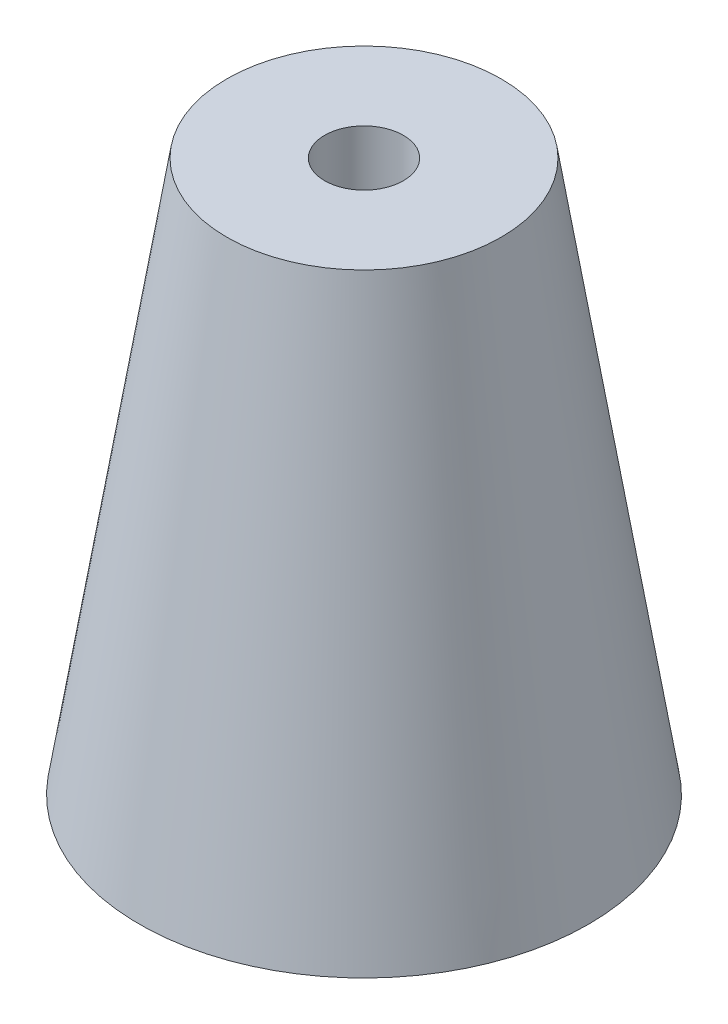
ISO-10303-21;
HEADER;
FILE_DESCRIPTION(('STEP AP214'),'2;1');
FILE_NAME('part.step','',(''),(''),'','','');
FILE_SCHEMA(('AUTOMOTIVE_DESIGN { 1 0 10303 214 1 1 1 1 }'));
ENDSEC;
DATA;
#1=APPLICATION_CONTEXT('core data for automotive mechanical design processes');
#2=APPLICATION_PROTOCOL_DEFINITION('international standard','automotive_design',2000,#1);
#3=PRODUCT_CONTEXT('',#1,'mechanical');
#4=PRODUCT('Part','Part','',(#3));
#5=PRODUCT_RELATED_PRODUCT_CATEGORY('part','',(#4));
#6=PRODUCT_DEFINITION_FORMATION('','',#4);
#7=PRODUCT_DEFINITION_CONTEXT('part definition',#1,'design');
#8=PRODUCT_DEFINITION('design','',#6,#7);
#9=PRODUCT_DEFINITION_SHAPE('','',#8);
#10=(LENGTH_UNIT() NAMED_UNIT(*) SI_UNIT(.MILLI.,.METRE.));
#11=(NAMED_UNIT(*) PLANE_ANGLE_UNIT() SI_UNIT($,.RADIAN.));
#12=(NAMED_UNIT(*) SI_UNIT($,.STERADIAN.) SOLID_ANGLE_UNIT());
#13=UNCERTAINTY_MEASURE_WITH_UNIT(LENGTH_MEASURE(1.E-05),#10,'distance_accuracy_value','');
#14=(GEOMETRIC_REPRESENTATION_CONTEXT(3) GLOBAL_UNCERTAINTY_ASSIGNED_CONTEXT((#13)) GLOBAL_UNIT_ASSIGNED_CONTEXT((#10,
#11,#12)) REPRESENTATION_CONTEXT('',''));
#15=CARTESIAN_POINT('',(0.,0.,0.));
#16=DIRECTION('',(0.,0.,1.));
#17=DIRECTION('',(1.,0.,0.));
#18=AXIS2_PLACEMENT_3D('',#15,#16,#17);
#19=CARTESIAN_POINT('',(0.,0.,0.));
#20=DIRECTION('',(0.,1.,0.));
#21=DIRECTION('',(-1.,0.,0.));
#22=AXIS2_PLACEMENT_3D('',#19,#20,#21);
#23=PLANE('',#22);
#24=CARTESIAN_POINT('',(0.,0.,0.));
#25=DIRECTION('',(0.,1.,0.));
#26=DIRECTION('',(-1.,0.,0.));
#27=AXIS2_PLACEMENT_3D('',#24,#25,#26);
#28=CIRCLE('',#27,7.62);
#29=CARTESIAN_POINT('',(-7.62,0.,0.));
#30=VERTEX_POINT('',#29);
#31=EDGE_CURVE('E82',#30,#30,#28,.F.);
#32=ORIENTED_EDGE('',*,*,#31,.T.);
#33=EDGE_LOOP('',(#32));
#34=FACE_BOUND('',#33,.T.);
#35=CARTESIAN_POINT('',(0.,0.,0.));
#36=DIRECTION('',(0.,-1.,0.));
#37=DIRECTION('',(1.,0.,0.));
#38=AXIS2_PLACEMENT_3D('',#35,#36,#37);
#39=CIRCLE('',#38,6.35);
#40=CARTESIAN_POINT('',(6.35,0.,0.));
#41=VERTEX_POINT('',#40);
#42=EDGE_CURVE('E76',#41,#41,#39,.T.);
#43=ORIENTED_EDGE('',*,*,#42,.F.);
#44=EDGE_LOOP('',(#43));
#45=FACE_BOUND('',#44,.T.);
#46=ADVANCED_FACE('F41',(#34,#45),#23,.F.);
#47=CARTESIAN_POINT('',(0.,0.,0.));
#48=DIRECTION('',(0.,1.,0.));
#49=DIRECTION('',(-1.,0.,0.));
#50=AXIS2_PLACEMENT_3D('',#47,#48,#49);
#51=CIRCLE('',#50,34.9091794421676);
#52=CARTESIAN_POINT('',(-34.9091794421676,0.,0.));
#53=VERTEX_POINT('',#52);
#54=EDGE_CURVE('E79',#53,#53,#51,.T.);
#55=ORIENTED_EDGE('',*,*,#54,.T.);
#56=EDGE_LOOP('',(#55));
#57=FACE_BOUND('',#56,.T.);
#58=CARTESIAN_POINT('',(0.,0.,0.));
#59=DIRECTION('',(0.,1.,0.));
#60=DIRECTION('',(-1.,0.,0.));
#61=AXIS2_PLACEMENT_3D('',#58,#59,#60);
#62=CIRCLE('',#61,36.195);
#63=CARTESIAN_POINT('',(-36.195,0.,0.));
#64=VERTEX_POINT('',#63);
#65=EDGE_CURVE('E68',#64,#64,#62,.T.);
#66=ORIENTED_EDGE('',*,*,#65,.F.);
#67=EDGE_LOOP('',(#66));
#68=FACE_BOUND('',#67,.T.);
#69=ADVANCED_FACE('F90',(#57,#68),#23,.F.);
#70=CARTESIAN_POINT('',(0.,0.,0.));
#71=DIRECTION('',(0.,-1.,0.));
#72=DIRECTION('',(1.,0.,0.));
#73=AXIS2_PLACEMENT_3D('',#70,#71,#72);
#74=CONICAL_SURFACE('',#73,36.195,0.157029775971732);
#75=CARTESIAN_POINT('',(0.,88.9,0.));
#76=DIRECTION('',(0.,1.,0.));
#77=DIRECTION('',(-1.,0.,0.));
#78=AXIS2_PLACEMENT_3D('',#75,#76,#77);
#79=CIRCLE('',#78,22.1191666666666);
#80=CARTESIAN_POINT('',(-22.1191666666666,88.9,0.));
#81=VERTEX_POINT('',#80);
#82=EDGE_CURVE('E72',#81,#81,#79,.T.);
#83=ORIENTED_EDGE('',*,*,#82,.F.);
#84=EDGE_LOOP('',(#83));
#85=FACE_BOUND('',#84,.T.);
#86=ORIENTED_EDGE('',*,*,#65,.T.);
#87=EDGE_LOOP('',(#86));
#88=FACE_BOUND('',#87,.T.);
#89=ADVANCED_FACE('F112',(#85,#88),#74,.T.);
#90=CARTESIAN_POINT('',(0.,88.9,0.));
#91=DIRECTION('',(0.,-1.,0.));
#92=DIRECTION('',(1.,0.,0.));
#93=AXIS2_PLACEMENT_3D('',#90,#91,#92);
#94=PLANE('',#93);
#95=CARTESIAN_POINT('',(0.,88.9,0.));
#96=DIRECTION('',(0.,-1.,0.));
#97=DIRECTION('',(1.,0.,0.));
#98=AXIS2_PLACEMENT_3D('',#95,#96,#97);
#99=CIRCLE('',#98,6.35);
#100=CARTESIAN_POINT('',(6.35000000000002,88.9,0.));
#101=VERTEX_POINT('',#100);
#102=EDGE_CURVE('E75',#101,#101,#99,.T.);
#103=ORIENTED_EDGE('',*,*,#102,.T.);
#104=EDGE_LOOP('',(#103));
#105=FACE_BOUND('',#104,.T.);
#106=ORIENTED_EDGE('',*,*,#82,.T.);
#107=EDGE_LOOP('',(#106));
#108=FACE_BOUND('',#107,.T.);
#109=ADVANCED_FACE('F104',(#105,#108),#94,.F.);
#110=CARTESIAN_POINT('',(0.,88.9,0.));
#111=DIRECTION('',(0.,-1.,0.));
#112=DIRECTION('',(1.,0.,0.));
#113=AXIS2_PLACEMENT_3D('',#110,#111,#112);
#114=CYLINDRICAL_SURFACE('',#113,6.35);
#115=ORIENTED_EDGE('',*,*,#102,.F.);
#116=EDGE_LOOP('',(#115));
#117=FACE_BOUND('',#116,.T.);
#118=ORIENTED_EDGE('',*,*,#42,.T.);
#119=EDGE_LOOP('',(#118));
#120=FACE_BOUND('',#119,.T.);
#121=ADVANCED_FACE('F96',(#117,#120),#114,.F.);
#122=CARTESIAN_POINT('',(0.,-0.198609231885217,0.));
#123=DIRECTION('',(0.,-1.,0.));
#124=DIRECTION('',(1.,0.,0.));
#125=AXIS2_PLACEMENT_3D('',#122,#123,#124);
#126=CONICAL_SURFACE('',#125,34.9406259038827,0.157029775971732);
#127=CARTESIAN_POINT('',(0.,85.4872184637705,0.));
#128=DIRECTION('',(0.,-1.,0.));
#129=DIRECTION('',(1.,0.,0.));
#130=AXIS2_PLACEMENT_3D('',#127,#128,#129);
#131=CIRCLE('',#130,21.3737031854039);
#132=CARTESIAN_POINT('',(21.3737031854039,85.4872184637705,0.));
#133=VERTEX_POINT('',#132);
#134=EDGE_CURVE('E62',#133,#133,#131,.F.);
#135=ORIENTED_EDGE('',*,*,#134,.T.);
#136=EDGE_LOOP('',(#135));
#137=FACE_BOUND('',#136,.T.);
#138=ORIENTED_EDGE('',*,*,#54,.F.);
#139=EDGE_LOOP('',(#138));
#140=FACE_BOUND('',#139,.T.);
#141=ADVANCED_FACE('F93',(#137,#140),#126,.F.);
#142=CARTESIAN_POINT('',(0.,87.63,0.));
#143=DIRECTION('',(0.,-1.,0.));
#144=DIRECTION('',(1.,0.,0.));
#145=AXIS2_PLACEMENT_3D('',#142,#143,#144);
#146=PLANE('',#145);
#147=CARTESIAN_POINT('',(0.,87.63,0.));
#148=DIRECTION('',(0.,-1.,0.));
#149=DIRECTION('',(1.,0.,0.));
#150=AXIS2_PLACEMENT_3D('',#147,#148,#149);
#151=CIRCLE('',#150,18.8649549931694);
#152=CARTESIAN_POINT('',(18.8649549931694,87.63,0.));
#153=VERTEX_POINT('',#152);
#154=EDGE_CURVE('E49',#153,#153,#151,.T.);
#155=ORIENTED_EDGE('',*,*,#154,.T.);
#156=EDGE_LOOP('',(#155));
#157=FACE_BOUND('',#156,.T.);
#158=CARTESIAN_POINT('',(0.,87.63,0.));
#159=DIRECTION('',(0.,-1.,0.));
#160=DIRECTION('',(1.,0.,0.));
#161=AXIS2_PLACEMENT_3D('',#158,#159,#160);
#162=CIRCLE('',#161,10.16);
#163=CARTESIAN_POINT('',(10.16,87.63,0.));
#164=VERTEX_POINT('',#163);
#165=EDGE_CURVE('E56',#164,#164,#162,.F.);
#166=ORIENTED_EDGE('',*,*,#165,.T.);
#167=EDGE_LOOP('',(#166));
#168=FACE_BOUND('',#167,.T.);
#169=ADVANCED_FACE('F95',(#157,#168),#146,.T.);
#170=CARTESIAN_POINT('',(0.,88.9,0.));
#171=DIRECTION('',(0.,-1.,0.));
#172=DIRECTION('',(1.,0.,0.));
#173=AXIS2_PLACEMENT_3D('',#170,#171,#172);
#174=CYLINDRICAL_SURFACE('',#173,7.62);
#175=CARTESIAN_POINT('',(0.,85.09,0.));
#176=DIRECTION('',(0.,-1.,0.));
#177=DIRECTION('',(1.,0.,0.));
#178=AXIS2_PLACEMENT_3D('',#175,#176,#177);
#179=CIRCLE('',#178,7.62);
#180=CARTESIAN_POINT('',(7.62000000000002,85.09,0.));
#181=VERTEX_POINT('',#180);
#182=EDGE_CURVE('E10',#181,#181,#179,.T.);
#183=ORIENTED_EDGE('',*,*,#182,.T.);
#184=EDGE_LOOP('',(#183));
#185=FACE_BOUND('',#184,.T.);
#186=ORIENTED_EDGE('',*,*,#31,.F.);
#187=EDGE_LOOP('',(#186));
#188=FACE_BOUND('',#187,.T.);
#189=ADVANCED_FACE('F102',(#185,#188),#174,.T.);
#190=CARTESIAN_POINT('',(0.,85.09,0.));
#191=DIRECTION('',(0.,-1.,0.));
#192=DIRECTION('',(1.,0.,0.));
#193=AXIS2_PLACEMENT_3D('',#190,#191,#192);
#194=TOROIDAL_SURFACE('',#193,18.8649549931694,2.54);
#195=ORIENTED_EDGE('',*,*,#154,.F.);
#196=EDGE_LOOP('',(#195));
#197=FACE_BOUND('',#196,.T.);
#198=ORIENTED_EDGE('',*,*,#134,.F.);
#199=EDGE_LOOP('',(#198));
#200=FACE_BOUND('',#199,.T.);
#201=ADVANCED_FACE('F116',(#197,#200),#194,.F.);
#202=CARTESIAN_POINT('',(0.,85.09,0.));
#203=DIRECTION('',(0.,-1.,0.));
#204=DIRECTION('',(1.,0.,0.));
#205=AXIS2_PLACEMENT_3D('',#202,#203,#204);
#206=TOROIDAL_SURFACE('',#205,10.16,2.54);
#207=ORIENTED_EDGE('',*,*,#165,.F.);
#208=EDGE_LOOP('',(#207));
#209=FACE_BOUND('',#208,.T.);
#210=ORIENTED_EDGE('',*,*,#182,.F.);
#211=EDGE_LOOP('',(#210));
#212=FACE_BOUND('',#211,.T.);
#213=ADVANCED_FACE('F43',(#209,#212),#206,.F.);
#214=CLOSED_SHELL('',(#46,#69,#89,#109,#121,#141,#169,#189,#201,#213));
#215=MANIFOLD_SOLID_BREP('B2',#214);
#216=ADVANCED_BREP_SHAPE_REPRESENTATION('',(#18,#215),#14);
#217=SHAPE_DEFINITION_REPRESENTATION(#9,#216);
ENDSEC;
END-ISO-10303-21;
